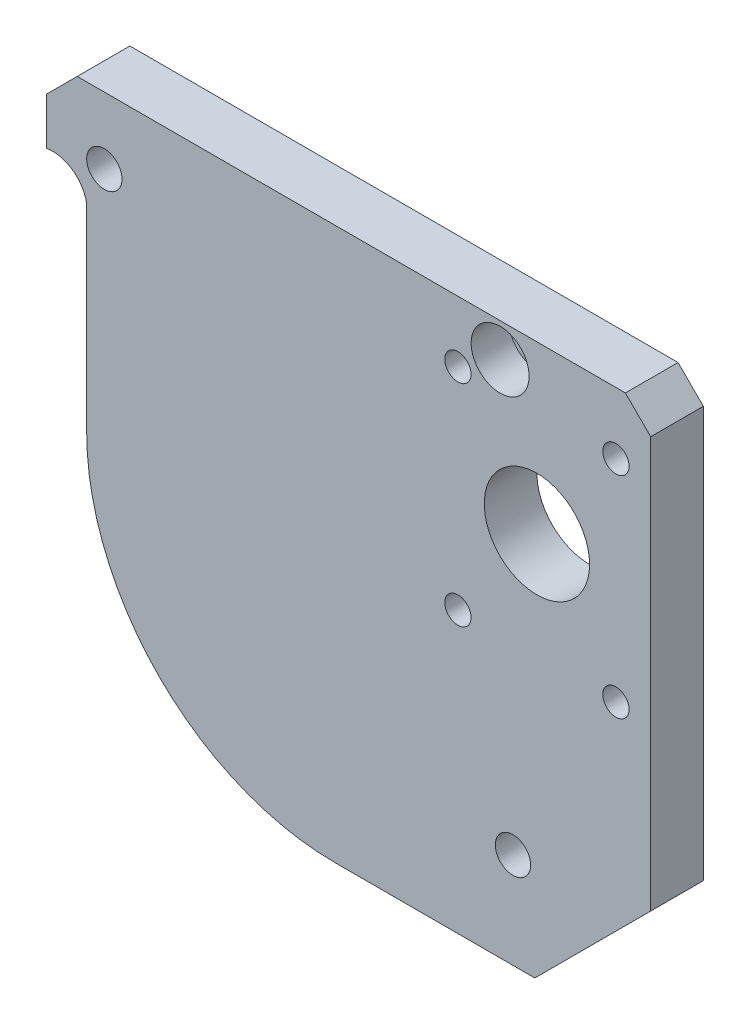
ISO-10303-21;
HEADER;
FILE_DESCRIPTION(('STEP AP214'),'2;1');
FILE_NAME('part.step','',(''),(''),'','','');
FILE_SCHEMA(('AUTOMOTIVE_DESIGN { 1 0 10303 214 1 1 1 1 }'));
ENDSEC;
DATA;
#1=APPLICATION_CONTEXT('core data for automotive mechanical design processes');
#2=APPLICATION_PROTOCOL_DEFINITION('international standard','automotive_design',2000,#1);
#3=PRODUCT_CONTEXT('',#1,'mechanical');
#4=PRODUCT('Part','Part','',(#3));
#5=PRODUCT_RELATED_PRODUCT_CATEGORY('part','',(#4));
#6=PRODUCT_DEFINITION_FORMATION('','',#4);
#7=PRODUCT_DEFINITION_CONTEXT('part definition',#1,'design');
#8=PRODUCT_DEFINITION('design','',#6,#7);
#9=PRODUCT_DEFINITION_SHAPE('','',#8);
#10=(LENGTH_UNIT() NAMED_UNIT(*) SI_UNIT(.MILLI.,.METRE.));
#11=(NAMED_UNIT(*) PLANE_ANGLE_UNIT() SI_UNIT($,.RADIAN.));
#12=(NAMED_UNIT(*) SI_UNIT($,.STERADIAN.) SOLID_ANGLE_UNIT());
#13=UNCERTAINTY_MEASURE_WITH_UNIT(LENGTH_MEASURE(1.E-05),#10,'distance_accuracy_value','');
#14=(GEOMETRIC_REPRESENTATION_CONTEXT(3) GLOBAL_UNCERTAINTY_ASSIGNED_CONTEXT((#13)) GLOBAL_UNIT_ASSIGNED_CONTEXT((#10,
#11,#12)) REPRESENTATION_CONTEXT('',''));
#15=CARTESIAN_POINT('',(0.,0.,0.));
#16=DIRECTION('',(0.,0.,1.));
#17=DIRECTION('',(1.,0.,0.));
#18=AXIS2_PLACEMENT_3D('',#15,#16,#17);
#19=CARTESIAN_POINT('',(4.826,53.8310431675768,0.));
#20=DIRECTION('',(1.,0.,0.));
#21=DIRECTION('',(0.,0.,-1.));
#22=AXIS2_PLACEMENT_3D('',#19,#20,#21);
#23=PLANE('',#22);
#24=DIRECTION('',(0.,0.,1.));
#25=VECTOR('',#24,1.);
#26=CARTESIAN_POINT('',(4.826,29.972,0.));
#27=LINE('',#26,#25);
#28=CARTESIAN_POINT('',(4.826,29.972,0.));
#29=VERTEX_POINT('',#28);
#30=CARTESIAN_POINT('',(4.826,29.972,6.35));
#31=VERTEX_POINT('',#30);
#32=EDGE_CURVE('E245',#29,#31,#27,.T.);
#33=ORIENTED_EDGE('',*,*,#32,.T.);
#34=DIRECTION('',(0.,1.,0.));
#35=VECTOR('',#34,1.);
#36=CARTESIAN_POINT('',(4.826,53.8310431675768,6.35));
#37=LINE('',#36,#35);
#38=CARTESIAN_POINT('',(4.826,53.8310431675768,6.35));
#39=VERTEX_POINT('',#38);
#40=EDGE_CURVE('E237',#31,#39,#37,.T.);
#41=ORIENTED_EDGE('',*,*,#40,.T.);
#42=DIRECTION('',(0.,0.,1.));
#43=VECTOR('',#42,1.);
#44=CARTESIAN_POINT('',(4.826,53.8310431675768,0.));
#45=LINE('',#44,#43);
#46=CARTESIAN_POINT('',(4.826,53.8310431675768,0.));
#47=VERTEX_POINT('',#46);
#48=EDGE_CURVE('E229',#47,#39,#45,.T.);
#49=ORIENTED_EDGE('',*,*,#48,.F.);
#50=DIRECTION('',(0.,1.,0.));
#51=VECTOR('',#50,1.);
#52=CARTESIAN_POINT('',(4.826,53.8310431675768,0.));
#53=LINE('',#52,#51);
#54=EDGE_CURVE('E234',#29,#47,#53,.T.);
#55=ORIENTED_EDGE('',*,*,#54,.F.);
#56=EDGE_LOOP('',(#33,#41,#49,#55));
#57=FACE_BOUND('',#56,.T.);
#58=ADVANCED_FACE('F32',(#57),#23,.F.);
#59=CARTESIAN_POINT('',(54.66715,62.46495,0.));
#60=DIRECTION('',(0.,0.,1.));
#61=DIRECTION('',(1.,0.,0.));
#62=AXIS2_PLACEMENT_3D('',#59,#60,#61);
#63=CYLINDRICAL_SURFACE('',#62,2.12725);
#64=CARTESIAN_POINT('',(54.66715,62.46495,0.));
#65=DIRECTION('',(0.,0.,1.));
#66=DIRECTION('',(1.,0.,0.));
#67=AXIS2_PLACEMENT_3D('',#64,#65,#66);
#68=CIRCLE('',#67,2.12725);
#69=CARTESIAN_POINT('',(56.7944,62.46495,0.));
#70=VERTEX_POINT('',#69);
#71=EDGE_CURVE('E144',#70,#70,#68,.T.);
#72=ORIENTED_EDGE('',*,*,#71,.F.);
#73=EDGE_LOOP('',(#72));
#74=FACE_BOUND('',#73,.T.);
#75=CARTESIAN_POINT('',(54.66715,62.46495,1.778));
#76=DIRECTION('',(0.,0.,1.));
#77=DIRECTION('',(1.,0.,0.));
#78=AXIS2_PLACEMENT_3D('',#75,#76,#77);
#79=CIRCLE('',#78,2.12725);
#80=CARTESIAN_POINT('',(56.7944,62.46495,1.778));
#81=VERTEX_POINT('',#80);
#82=EDGE_CURVE('E141',#81,#81,#79,.F.);
#83=ORIENTED_EDGE('',*,*,#82,.F.);
#84=EDGE_LOOP('',(#83));
#85=FACE_BOUND('',#84,.T.);
#86=ADVANCED_FACE('F283',(#74,#85),#63,.F.);
#87=CARTESIAN_POINT('',(72.8218,0.,6.35));
#88=DIRECTION('',(0.,1.,0.));
#89=DIRECTION('',(-1.,0.,0.));
#90=AXIS2_PLACEMENT_3D('',#87,#88,#89);
#91=PLANE('',#90);
#92=DIRECTION('',(1.,0.,0.));
#93=VECTOR('',#92,1.);
#94=CARTESIAN_POINT('',(72.8218,0.,6.35));
#95=LINE('',#94,#93);
#96=CARTESIAN_POINT('',(34.798,0.,6.35));
#97=VERTEX_POINT('',#96);
#98=CARTESIAN_POINT('',(58.8517999999998,0.,6.35));
#99=VERTEX_POINT('',#98);
#100=EDGE_CURVE('E135',#97,#99,#95,.T.);
#101=ORIENTED_EDGE('',*,*,#100,.F.);
#102=DIRECTION('',(0.,0.,1.));
#103=VECTOR('',#102,1.);
#104=CARTESIAN_POINT('',(34.798,0.,0.));
#105=LINE('',#104,#103);
#106=CARTESIAN_POINT('',(34.798,0.,0.));
#107=VERTEX_POINT('',#106);
#108=EDGE_CURVE('E207',#107,#97,#105,.T.);
#109=ORIENTED_EDGE('',*,*,#108,.F.);
#110=DIRECTION('',(1.,0.,0.));
#111=VECTOR('',#110,1.);
#112=CARTESIAN_POINT('',(72.8218,0.,0.));
#113=LINE('',#112,#111);
#114=CARTESIAN_POINT('',(58.8517999999999,0.,0.));
#115=VERTEX_POINT('',#114);
#116=EDGE_CURVE('E137',#107,#115,#113,.T.);
#117=ORIENTED_EDGE('',*,*,#116,.T.);
#118=DIRECTION('',(0.,0.,1.));
#119=VECTOR('',#118,1.);
#120=CARTESIAN_POINT('',(58.8517999999998,0.,0.));
#121=LINE('',#120,#119);
#122=EDGE_CURVE('E206',#115,#99,#121,.T.);
#123=ORIENTED_EDGE('',*,*,#122,.T.);
#124=EDGE_LOOP('',(#101,#109,#117,#123));
#125=FACE_BOUND('',#124,.T.);
#126=ADVANCED_FACE('F34',(#125),#91,.F.);
#127=CARTESIAN_POINT('',(72.8218,66.548,6.35));
#128=DIRECTION('',(-1.,0.,0.));
#129=DIRECTION('',(0.,-1.,0.));
#130=AXIS2_PLACEMENT_3D('',#127,#128,#129);
#131=PLANE('',#130);
#132=DIRECTION('',(0.,1.,0.));
#133=VECTOR('',#132,1.);
#134=CARTESIAN_POINT('',(72.8218,66.548,0.));
#135=LINE('',#134,#133);
#136=CARTESIAN_POINT('',(72.8218,13.97,0.));
#137=VERTEX_POINT('',#136);
#138=CARTESIAN_POINT('',(72.8218,63.5,0.));
#139=VERTEX_POINT('',#138);
#140=EDGE_CURVE('E132',#137,#139,#135,.T.);
#141=ORIENTED_EDGE('',*,*,#140,.T.);
#142=DIRECTION('',(0.,0.,1.));
#143=VECTOR('',#142,1.);
#144=CARTESIAN_POINT('',(72.8218,63.5,0.));
#145=LINE('',#144,#143);
#146=CARTESIAN_POINT('',(72.8218,63.5,6.35));
#147=VERTEX_POINT('',#146);
#148=EDGE_CURVE('E49',#139,#147,#145,.T.);
#149=ORIENTED_EDGE('',*,*,#148,.T.);
#150=DIRECTION('',(0.,1.,0.));
#151=VECTOR('',#150,1.);
#152=CARTESIAN_POINT('',(72.8218,66.548,6.35));
#153=LINE('',#152,#151);
#154=CARTESIAN_POINT('',(72.8218,13.97,6.35));
#155=VERTEX_POINT('',#154);
#156=EDGE_CURVE('E197',#155,#147,#153,.T.);
#157=ORIENTED_EDGE('',*,*,#156,.F.);
#158=DIRECTION('',(0.,0.,1.));
#159=VECTOR('',#158,1.);
#160=CARTESIAN_POINT('',(72.8218,13.97,0.));
#161=LINE('',#160,#159);
#162=EDGE_CURVE('E217',#137,#155,#161,.T.);
#163=ORIENTED_EDGE('',*,*,#162,.F.);
#164=EDGE_LOOP('',(#141,#149,#157,#163));
#165=FACE_BOUND('',#164,.T.);
#166=ADVANCED_FACE('F255',(#165),#131,.F.);
#167=CARTESIAN_POINT('',(0.,66.548,6.35));
#168=DIRECTION('',(0.,-1.,0.));
#169=DIRECTION('',(0.,0.,-1.));
#170=AXIS2_PLACEMENT_3D('',#167,#168,#169);
#171=PLANE('',#170);
#172=DIRECTION('',(-1.,0.,0.));
#173=VECTOR('',#172,1.);
#174=CARTESIAN_POINT('',(0.,66.548,6.35));
#175=LINE('',#174,#173);
#176=CARTESIAN_POINT('',(69.7738,66.548,6.35));
#177=VERTEX_POINT('',#176);
#178=CARTESIAN_POINT('',(3.68300000000006,66.548,6.35));
#179=VERTEX_POINT('',#178);
#180=EDGE_CURVE('E41',#177,#179,#175,.T.);
#181=ORIENTED_EDGE('',*,*,#180,.F.);
#182=DIRECTION('',(0.,0.,1.));
#183=VECTOR('',#182,1.);
#184=CARTESIAN_POINT('',(69.7738,66.548,0.));
#185=LINE('',#184,#183);
#186=CARTESIAN_POINT('',(69.7738,66.548,0.));
#187=VERTEX_POINT('',#186);
#188=EDGE_CURVE('E111',#187,#177,#185,.T.);
#189=ORIENTED_EDGE('',*,*,#188,.F.);
#190=DIRECTION('',(-1.,0.,0.));
#191=VECTOR('',#190,1.);
#192=CARTESIAN_POINT('',(0.,66.548,0.));
#193=LINE('',#192,#191);
#194=CARTESIAN_POINT('',(3.68300000000008,66.548,0.));
#195=VERTEX_POINT('',#194);
#196=EDGE_CURVE('E123',#187,#195,#193,.T.);
#197=ORIENTED_EDGE('',*,*,#196,.T.);
#198=DIRECTION('',(0.,0.,1.));
#199=VECTOR('',#198,1.);
#200=CARTESIAN_POINT('',(3.68300000000006,66.548,0.));
#201=LINE('',#200,#199);
#202=EDGE_CURVE('E220',#195,#179,#201,.T.);
#203=ORIENTED_EDGE('',*,*,#202,.T.);
#204=EDGE_LOOP('',(#181,#189,#197,#203));
#205=FACE_BOUND('',#204,.T.);
#206=ADVANCED_FACE('F121',(#205),#171,.F.);
#207=CARTESIAN_POINT('',(0.,0.,6.35));
#208=DIRECTION('',(1.,0.,0.));
#209=DIRECTION('',(0.,0.,-1.));
#210=AXIS2_PLACEMENT_3D('',#207,#208,#209);
#211=PLANE('',#210);
#212=DIRECTION('',(0.,-1.,0.));
#213=VECTOR('',#212,1.);
#214=CARTESIAN_POINT('',(0.,0.,0.));
#215=LINE('',#214,#213);
#216=CARTESIAN_POINT('',(0.,62.865,0.));
#217=VERTEX_POINT('',#216);
#218=CARTESIAN_POINT('',(0.,57.1925416335368,0.));
#219=VERTEX_POINT('',#218);
#220=EDGE_CURVE('E131',#217,#219,#215,.T.);
#221=ORIENTED_EDGE('',*,*,#220,.T.);
#222=DIRECTION('',(0.,0.,1.));
#223=VECTOR('',#222,1.);
#224=CARTESIAN_POINT('',(0.,57.1925416335368,0.));
#225=LINE('',#224,#223);
#226=CARTESIAN_POINT('',(0.,57.1925416335368,6.35));
#227=VERTEX_POINT('',#226);
#228=EDGE_CURVE('E231',#219,#227,#225,.T.);
#229=ORIENTED_EDGE('',*,*,#228,.T.);
#230=DIRECTION('',(0.,-1.,0.));
#231=VECTOR('',#230,1.);
#232=CARTESIAN_POINT('',(0.,0.,6.35));
#233=LINE('',#232,#231);
#234=CARTESIAN_POINT('',(0.,62.865,6.35));
#235=VERTEX_POINT('',#234);
#236=EDGE_CURVE('E11',#235,#227,#233,.T.);
#237=ORIENTED_EDGE('',*,*,#236,.F.);
#238=DIRECTION('',(0.,0.,1.));
#239=VECTOR('',#238,1.);
#240=CARTESIAN_POINT('',(0.,62.865,0.));
#241=LINE('',#240,#239);
#242=EDGE_CURVE('E223',#217,#235,#241,.T.);
#243=ORIENTED_EDGE('',*,*,#242,.F.);
#244=EDGE_LOOP('',(#221,#229,#237,#243));
#245=FACE_BOUND('',#244,.T.);
#246=ADVANCED_FACE('F267',(#245),#211,.F.);
#247=CARTESIAN_POINT('',(0.,0.,6.35));
#248=DIRECTION('',(0.,0.,-1.));
#249=DIRECTION('',(-1.,0.,0.));
#250=AXIS2_PLACEMENT_3D('',#247,#248,#249);
#251=PLANE('',#250);
#252=CARTESIAN_POINT('',(49.5808,59.182,6.35));
#253=DIRECTION('',(0.,0.,1.));
#254=DIRECTION('',(1.,0.,0.));
#255=AXIS2_PLACEMENT_3D('',#252,#253,#254);
#256=CIRCLE('',#255,1.5875);
#257=CARTESIAN_POINT('',(51.1683,59.182,6.35));
#258=VERTEX_POINT('',#257);
#259=EDGE_CURVE('E166',#258,#258,#256,.T.);
#260=ORIENTED_EDGE('',*,*,#259,.F.);
#261=EDGE_LOOP('',(#260));
#262=FACE_BOUND('',#261,.T.);
#263=CARTESIAN_POINT('',(68.6308,59.1091100492552,6.35));
#264=DIRECTION('',(0.,0.,1.));
#265=DIRECTION('',(1.,0.,0.));
#266=AXIS2_PLACEMENT_3D('',#263,#264,#265);
#267=CIRCLE('',#266,1.58749999999999);
#268=CARTESIAN_POINT('',(70.2183,59.1091100492552,6.35));
#269=VERTEX_POINT('',#268);
#270=EDGE_CURVE('E156',#269,#269,#267,.T.);
#271=ORIENTED_EDGE('',*,*,#270,.F.);
#272=EDGE_LOOP('',(#271));
#273=FACE_BOUND('',#272,.T.);
#274=CARTESIAN_POINT('',(68.6306605521179,33.709110049638,6.35));
#275=DIRECTION('',(0.,0.,1.));
#276=DIRECTION('',(1.,0.,0.));
#277=AXIS2_PLACEMENT_3D('',#274,#275,#276);
#278=CIRCLE('',#277,1.58749999999999);
#279=CARTESIAN_POINT('',(70.2181605521179,33.709110049638,6.35));
#280=VERTEX_POINT('',#279);
#281=EDGE_CURVE('E153',#280,#280,#278,.T.);
#282=ORIENTED_EDGE('',*,*,#281,.F.);
#283=EDGE_LOOP('',(#282));
#284=FACE_BOUND('',#283,.T.);
#285=CARTESIAN_POINT('',(49.5808,33.782,6.35));
#286=DIRECTION('',(0.,0.,1.));
#287=DIRECTION('',(1.,0.,0.));
#288=AXIS2_PLACEMENT_3D('',#285,#286,#287);
#289=CIRCLE('',#288,1.5875);
#290=CARTESIAN_POINT('',(51.1683,33.782,6.35));
#291=VERTEX_POINT('',#290);
#292=EDGE_CURVE('E150',#291,#291,#289,.T.);
#293=ORIENTED_EDGE('',*,*,#292,.F.);
#294=EDGE_LOOP('',(#293));
#295=FACE_BOUND('',#294,.T.);
#296=CARTESIAN_POINT('',(54.66715,62.46495,6.35));
#297=DIRECTION('',(0.,0.,1.));
#298=DIRECTION('',(1.,0.,0.));
#299=AXIS2_PLACEMENT_3D('',#296,#297,#298);
#300=CIRCLE('',#299,3.49250000000001);
#301=CARTESIAN_POINT('',(58.15965,62.46495,6.35));
#302=VERTEX_POINT('',#301);
#303=EDGE_CURVE('E149',#302,#302,#300,.T.);
#304=ORIENTED_EDGE('',*,*,#303,.F.);
#305=EDGE_LOOP('',(#304));
#306=FACE_BOUND('',#305,.T.);
#307=CARTESIAN_POINT('',(6.95325,58.51525,6.35));
#308=DIRECTION('',(0.,0.,1.));
#309=DIRECTION('',(1.,0.,0.));
#310=AXIS2_PLACEMENT_3D('',#307,#308,#309);
#311=CIRCLE('',#310,2.12725);
#312=CARTESIAN_POINT('',(9.0805,58.51525,6.35));
#313=VERTEX_POINT('',#312);
#314=EDGE_CURVE('E178',#313,#313,#311,.T.);
#315=ORIENTED_EDGE('',*,*,#314,.F.);
#316=EDGE_LOOP('',(#315));
#317=FACE_BOUND('',#316,.T.);
#318=CARTESIAN_POINT('',(56.21655,11.52525,6.35));
#319=DIRECTION('',(0.,0.,1.));
#320=DIRECTION('',(1.,0.,0.));
#321=AXIS2_PLACEMENT_3D('',#318,#319,#320);
#322=CIRCLE('',#321,2.12725);
#323=CARTESIAN_POINT('',(58.3438,11.52525,6.35));
#324=VERTEX_POINT('',#323);
#325=EDGE_CURVE('E182',#324,#324,#322,.T.);
#326=ORIENTED_EDGE('',*,*,#325,.F.);
#327=EDGE_LOOP('',(#326));
#328=FACE_BOUND('',#327,.T.);
#329=CARTESIAN_POINT('',(59.1058,46.482,6.35));
#330=DIRECTION('',(0.,0.,1.));
#331=DIRECTION('',(1.,0.,0.));
#332=AXIS2_PLACEMENT_3D('',#329,#330,#331);
#333=CIRCLE('',#332,6.35000000000002);
#334=CARTESIAN_POINT('',(65.4558,46.482,6.35));
#335=VERTEX_POINT('',#334);
#336=EDGE_CURVE('E188',#335,#335,#333,.T.);
#337=ORIENTED_EDGE('',*,*,#336,.F.);
#338=EDGE_LOOP('',(#337));
#339=FACE_BOUND('',#338,.T.);
#340=ORIENTED_EDGE('',*,*,#156,.T.);
#341=DIRECTION('',(0.707106781186546,-0.707106781186549,0.));
#342=VECTOR('',#341,1.);
#343=CARTESIAN_POINT('',(69.7738,66.548,6.35));
#344=LINE('',#343,#342);
#345=EDGE_CURVE('E117',#177,#147,#344,.T.);
#346=ORIENTED_EDGE('',*,*,#345,.F.);
#347=ORIENTED_EDGE('',*,*,#180,.T.);
#348=DIRECTION('',(0.707106781186553,0.707106781186542,0.));
#349=VECTOR('',#348,1.);
#350=CARTESIAN_POINT('',(3.68300000000006,66.548,6.35));
#351=LINE('',#350,#349);
#352=EDGE_CURVE('E226',#235,#179,#351,.T.);
#353=ORIENTED_EDGE('',*,*,#352,.F.);
#354=ORIENTED_EDGE('',*,*,#236,.T.);
#355=CARTESIAN_POINT('',(0.732250767019983,53.0987924005568,6.35));
#356=DIRECTION('',(0.,0.,1.));
#357=DIRECTION('',(-1.,0.,0.));
#358=AXIS2_PLACEMENT_3D('',#355,#356,#357);
#359=CIRCLE('',#358,4.15872263661883);
#360=EDGE_CURVE('E240',#39,#227,#359,.T.);
#361=ORIENTED_EDGE('',*,*,#360,.F.);
#362=ORIENTED_EDGE('',*,*,#40,.F.);
#363=CARTESIAN_POINT('',(34.798,29.972,6.35));
#364=DIRECTION('',(0.,0.,-1.));
#365=DIRECTION('',(-1.,0.,0.));
#366=AXIS2_PLACEMENT_3D('',#363,#364,#365);
#367=CIRCLE('',#366,29.972);
#368=EDGE_CURVE('E57',#97,#31,#367,.T.);
#369=ORIENTED_EDGE('',*,*,#368,.F.);
#370=ORIENTED_EDGE('',*,*,#100,.T.);
#371=DIRECTION('',(-0.707106781186552,-0.707106781186543,0.));
#372=VECTOR('',#371,1.);
#373=CARTESIAN_POINT('',(72.8218,13.97,6.35));
#374=LINE('',#373,#372);
#375=EDGE_CURVE('E216',#155,#99,#374,.T.);
#376=ORIENTED_EDGE('',*,*,#375,.F.);
#377=EDGE_LOOP('',(#340,#346,#347,#353,#354,#361,#362,#369,#370,#376));
#378=FACE_BOUND('',#377,.T.);
#379=ADVANCED_FACE('F256',(#262,#273,#284,#295,#306,#317,#328,#339,#378),#251,.F.);
#380=CARTESIAN_POINT('',(0.,0.,0.));
#381=DIRECTION('',(0.,0.,-1.));
#382=DIRECTION('',(-1.,0.,0.));
#383=AXIS2_PLACEMENT_3D('',#380,#381,#382);
#384=PLANE('',#383);
#385=DIRECTION('',(0.707106781186546,-0.707106781186549,0.));
#386=VECTOR('',#385,1.);
#387=CARTESIAN_POINT('',(69.7738,66.548,0.));
#388=LINE('',#387,#386);
#389=EDGE_CURVE('E108',#187,#139,#388,.T.);
#390=ORIENTED_EDGE('',*,*,#389,.T.);
#391=ORIENTED_EDGE('',*,*,#140,.F.);
#392=DIRECTION('',(-0.707106781186552,-0.707106781186543,0.));
#393=VECTOR('',#392,1.);
#394=CARTESIAN_POINT('',(72.8218,13.97,0.));
#395=LINE('',#394,#393);
#396=EDGE_CURVE('E213',#137,#115,#395,.T.);
#397=ORIENTED_EDGE('',*,*,#396,.T.);
#398=ORIENTED_EDGE('',*,*,#116,.F.);
#399=CARTESIAN_POINT('',(34.798,29.972,0.));
#400=DIRECTION('',(0.,0.,-1.));
#401=DIRECTION('',(-1.,0.,0.));
#402=AXIS2_PLACEMENT_3D('',#399,#400,#401);
#403=CIRCLE('',#402,29.972);
#404=EDGE_CURVE('E247',#107,#29,#403,.T.);
#405=ORIENTED_EDGE('',*,*,#404,.T.);
#406=ORIENTED_EDGE('',*,*,#54,.T.);
#407=CARTESIAN_POINT('',(0.732250767019983,53.0987924005568,0.));
#408=DIRECTION('',(0.,0.,1.));
#409=DIRECTION('',(-1.,0.,0.));
#410=AXIS2_PLACEMENT_3D('',#407,#408,#409);
#411=CIRCLE('',#410,4.15872263661883);
#412=EDGE_CURVE('E239',#47,#219,#411,.T.);
#413=ORIENTED_EDGE('',*,*,#412,.T.);
#414=ORIENTED_EDGE('',*,*,#220,.F.);
#415=DIRECTION('',(0.707106781186553,0.707106781186542,0.));
#416=VECTOR('',#415,1.);
#417=CARTESIAN_POINT('',(3.68300000000006,66.548,0.));
#418=LINE('',#417,#416);
#419=EDGE_CURVE('E130',#217,#195,#418,.T.);
#420=ORIENTED_EDGE('',*,*,#419,.T.);
#421=ORIENTED_EDGE('',*,*,#196,.F.);
#422=EDGE_LOOP('',(#390,#391,#397,#398,#405,#406,#413,#414,#420,#421));
#423=FACE_BOUND('',#422,.T.);
#424=CARTESIAN_POINT('',(49.5808,59.182,0.));
#425=DIRECTION('',(0.,0.,-1.));
#426=DIRECTION('',(-1.,0.,0.));
#427=AXIS2_PLACEMENT_3D('',#424,#425,#426);
#428=CIRCLE('',#427,1.5875);
#429=CARTESIAN_POINT('',(47.9933,59.182,0.));
#430=VERTEX_POINT('',#429);
#431=EDGE_CURVE('E36',#430,#430,#428,.T.);
#432=ORIENTED_EDGE('',*,*,#431,.F.);
#433=EDGE_LOOP('',(#432));
#434=FACE_BOUND('',#433,.T.);
#435=CARTESIAN_POINT('',(68.6308,59.1091100492552,0.));
#436=DIRECTION('',(0.,0.,-1.));
#437=DIRECTION('',(-1.,0.,0.));
#438=AXIS2_PLACEMENT_3D('',#435,#436,#437);
#439=CIRCLE('',#438,1.58749999999999);
#440=CARTESIAN_POINT('',(67.0433,59.1091100492552,0.));
#441=VERTEX_POINT('',#440);
#442=EDGE_CURVE('E154',#441,#441,#439,.T.);
#443=ORIENTED_EDGE('',*,*,#442,.F.);
#444=EDGE_LOOP('',(#443));
#445=FACE_BOUND('',#444,.T.);
#446=CARTESIAN_POINT('',(68.6306605521179,33.709110049638,0.));
#447=DIRECTION('',(0.,0.,-1.));
#448=DIRECTION('',(-1.,0.,0.));
#449=AXIS2_PLACEMENT_3D('',#446,#447,#448);
#450=CIRCLE('',#449,1.58749999999999);
#451=CARTESIAN_POINT('',(67.0431605521179,33.709110049638,0.));
#452=VERTEX_POINT('',#451);
#453=EDGE_CURVE('E151',#452,#452,#450,.T.);
#454=ORIENTED_EDGE('',*,*,#453,.F.);
#455=EDGE_LOOP('',(#454));
#456=FACE_BOUND('',#455,.T.);
#457=CARTESIAN_POINT('',(49.5808,33.782,0.));
#458=DIRECTION('',(0.,0.,-1.));
#459=DIRECTION('',(-1.,0.,0.));
#460=AXIS2_PLACEMENT_3D('',#457,#458,#459);
#461=CIRCLE('',#460,1.5875);
#462=CARTESIAN_POINT('',(47.9933,33.782,0.));
#463=VERTEX_POINT('',#462);
#464=EDGE_CURVE('E146',#463,#463,#461,.T.);
#465=ORIENTED_EDGE('',*,*,#464,.F.);
#466=EDGE_LOOP('',(#465));
#467=FACE_BOUND('',#466,.T.);
#468=ORIENTED_EDGE('',*,*,#71,.T.);
#469=EDGE_LOOP('',(#468));
#470=FACE_BOUND('',#469,.T.);
#471=CARTESIAN_POINT('',(6.95325,58.51525,0.));
#472=DIRECTION('',(0.,0.,1.));
#473=DIRECTION('',(1.,0.,0.));
#474=AXIS2_PLACEMENT_3D('',#471,#472,#473);
#475=CIRCLE('',#474,2.12725);
#476=CARTESIAN_POINT('',(9.0805,58.51525,0.));
#477=VERTEX_POINT('',#476);
#478=EDGE_CURVE('E179',#477,#477,#475,.T.);
#479=ORIENTED_EDGE('',*,*,#478,.T.);
#480=EDGE_LOOP('',(#479));
#481=FACE_BOUND('',#480,.T.);
#482=CARTESIAN_POINT('',(56.21655,11.52525,0.));
#483=DIRECTION('',(0.,0.,1.));
#484=DIRECTION('',(1.,0.,0.));
#485=AXIS2_PLACEMENT_3D('',#482,#483,#484);
#486=CIRCLE('',#485,2.12725);
#487=CARTESIAN_POINT('',(58.3438,11.52525,0.));
#488=VERTEX_POINT('',#487);
#489=EDGE_CURVE('E185',#488,#488,#486,.T.);
#490=ORIENTED_EDGE('',*,*,#489,.T.);
#491=EDGE_LOOP('',(#490));
#492=FACE_BOUND('',#491,.T.);
#493=CARTESIAN_POINT('',(59.1058,46.482,0.));
#494=DIRECTION('',(0.,0.,1.));
#495=DIRECTION('',(1.,0.,0.));
#496=AXIS2_PLACEMENT_3D('',#493,#494,#495);
#497=CIRCLE('',#496,6.35000000000002);
#498=CARTESIAN_POINT('',(65.4558,46.482,0.));
#499=VERTEX_POINT('',#498);
#500=EDGE_CURVE('E191',#499,#499,#497,.T.);
#501=ORIENTED_EDGE('',*,*,#500,.T.);
#502=EDGE_LOOP('',(#501));
#503=FACE_BOUND('',#502,.T.);
#504=ADVANCED_FACE('F127',(#423,#434,#445,#456,#467,#470,#481,#492,#503),#384,.T.);
#505=CARTESIAN_POINT('',(59.1058,46.482,0.));
#506=DIRECTION('',(0.,0.,1.));
#507=DIRECTION('',(1.,0.,0.));
#508=AXIS2_PLACEMENT_3D('',#505,#506,#507);
#509=CYLINDRICAL_SURFACE('',#508,6.35000000000002);
#510=ORIENTED_EDGE('',*,*,#500,.F.);
#511=EDGE_LOOP('',(#510));
#512=FACE_BOUND('',#511,.T.);
#513=ORIENTED_EDGE('',*,*,#336,.T.);
#514=EDGE_LOOP('',(#513));
#515=FACE_BOUND('',#514,.T.);
#516=ADVANCED_FACE('F360',(#512,#515),#509,.F.);
#517=CARTESIAN_POINT('',(56.21655,11.52525,0.));
#518=DIRECTION('',(0.,0.,1.));
#519=DIRECTION('',(1.,0.,0.));
#520=AXIS2_PLACEMENT_3D('',#517,#518,#519);
#521=CYLINDRICAL_SURFACE('',#520,2.12725);
#522=ORIENTED_EDGE('',*,*,#489,.F.);
#523=EDGE_LOOP('',(#522));
#524=FACE_BOUND('',#523,.T.);
#525=ORIENTED_EDGE('',*,*,#325,.T.);
#526=EDGE_LOOP('',(#525));
#527=FACE_BOUND('',#526,.T.);
#528=ADVANCED_FACE('F369',(#524,#527),#521,.F.);
#529=CARTESIAN_POINT('',(6.95325,58.51525,0.));
#530=DIRECTION('',(0.,0.,1.));
#531=DIRECTION('',(1.,0.,0.));
#532=AXIS2_PLACEMENT_3D('',#529,#530,#531);
#533=CYLINDRICAL_SURFACE('',#532,2.12725);
#534=ORIENTED_EDGE('',*,*,#478,.F.);
#535=EDGE_LOOP('',(#534));
#536=FACE_BOUND('',#535,.T.);
#537=ORIENTED_EDGE('',*,*,#314,.T.);
#538=EDGE_LOOP('',(#537));
#539=FACE_BOUND('',#538,.T.);
#540=ADVANCED_FACE('F376',(#536,#539),#533,.F.);
#541=CARTESIAN_POINT('',(54.66715,62.46495,1.778));
#542=DIRECTION('',(0.,0.,1.));
#543=DIRECTION('',(1.,0.,0.));
#544=AXIS2_PLACEMENT_3D('',#541,#542,#543);
#545=PLANE('',#544);
#546=CARTESIAN_POINT('',(54.66715,62.46495,1.778));
#547=DIRECTION('',(0.,0.,1.));
#548=DIRECTION('',(1.,0.,0.));
#549=AXIS2_PLACEMENT_3D('',#546,#547,#548);
#550=CIRCLE('',#549,3.49250000000001);
#551=CARTESIAN_POINT('',(58.15965,62.46495,1.778));
#552=VERTEX_POINT('',#551);
#553=EDGE_CURVE('E145',#552,#552,#550,.T.);
#554=ORIENTED_EDGE('',*,*,#553,.T.);
#555=EDGE_LOOP('',(#554));
#556=FACE_BOUND('',#555,.T.);
#557=ORIENTED_EDGE('',*,*,#82,.T.);
#558=EDGE_LOOP('',(#557));
#559=FACE_BOUND('',#558,.T.);
#560=ADVANCED_FACE('F384',(#556,#559),#545,.T.);
#561=CARTESIAN_POINT('',(54.66715,62.46495,1.778));
#562=DIRECTION('',(0.,0.,1.));
#563=DIRECTION('',(1.,0.,0.));
#564=AXIS2_PLACEMENT_3D('',#561,#562,#563);
#565=CYLINDRICAL_SURFACE('',#564,3.49250000000001);
#566=ORIENTED_EDGE('',*,*,#553,.F.);
#567=EDGE_LOOP('',(#566));
#568=FACE_BOUND('',#567,.T.);
#569=ORIENTED_EDGE('',*,*,#303,.T.);
#570=EDGE_LOOP('',(#569));
#571=FACE_BOUND('',#570,.T.);
#572=ADVANCED_FACE('F392',(#568,#571),#565,.F.);
#573=CARTESIAN_POINT('',(49.5808,33.782,6.35));
#574=DIRECTION('',(0.,0.,1.));
#575=DIRECTION('',(1.,0.,0.));
#576=AXIS2_PLACEMENT_3D('',#573,#574,#575);
#577=CYLINDRICAL_SURFACE('',#576,1.5875);
#578=ORIENTED_EDGE('',*,*,#464,.T.);
#579=EDGE_LOOP('',(#578));
#580=FACE_BOUND('',#579,.T.);
#581=ORIENTED_EDGE('',*,*,#292,.T.);
#582=EDGE_LOOP('',(#581));
#583=FACE_BOUND('',#582,.T.);
#584=ADVANCED_FACE('F400',(#580,#583),#577,.F.);
#585=CARTESIAN_POINT('',(68.6306605521179,33.709110049638,6.35));
#586=DIRECTION('',(0.,0.,1.));
#587=DIRECTION('',(1.,0.,0.));
#588=AXIS2_PLACEMENT_3D('',#585,#586,#587);
#589=CYLINDRICAL_SURFACE('',#588,1.58749999999999);
#590=ORIENTED_EDGE('',*,*,#453,.T.);
#591=EDGE_LOOP('',(#590));
#592=FACE_BOUND('',#591,.T.);
#593=ORIENTED_EDGE('',*,*,#281,.T.);
#594=EDGE_LOOP('',(#593));
#595=FACE_BOUND('',#594,.T.);
#596=ADVANCED_FACE('F408',(#592,#595),#589,.F.);
#597=CARTESIAN_POINT('',(68.6308,59.1091100492552,6.35));
#598=DIRECTION('',(0.,0.,1.));
#599=DIRECTION('',(1.,0.,0.));
#600=AXIS2_PLACEMENT_3D('',#597,#598,#599);
#601=CYLINDRICAL_SURFACE('',#600,1.58749999999999);
#602=ORIENTED_EDGE('',*,*,#442,.T.);
#603=EDGE_LOOP('',(#602));
#604=FACE_BOUND('',#603,.T.);
#605=ORIENTED_EDGE('',*,*,#270,.T.);
#606=EDGE_LOOP('',(#605));
#607=FACE_BOUND('',#606,.T.);
#608=ADVANCED_FACE('F416',(#604,#607),#601,.F.);
#609=CARTESIAN_POINT('',(49.5808,59.182,6.35));
#610=DIRECTION('',(0.,0.,1.));
#611=DIRECTION('',(1.,0.,0.));
#612=AXIS2_PLACEMENT_3D('',#609,#610,#611);
#613=CYLINDRICAL_SURFACE('',#612,1.5875);
#614=ORIENTED_EDGE('',*,*,#431,.T.);
#615=EDGE_LOOP('',(#614));
#616=FACE_BOUND('',#615,.T.);
#617=ORIENTED_EDGE('',*,*,#259,.T.);
#618=EDGE_LOOP('',(#617));
#619=FACE_BOUND('',#618,.T.);
#620=ADVANCED_FACE('F280',(#616,#619),#613,.F.);
#621=CARTESIAN_POINT('',(72.8218,13.97,0.));
#622=DIRECTION('',(-0.707106781186543,0.707106781186552,0.));
#623=DIRECTION('',(-0.707106781186552,-0.707106781186543,0.));
#624=AXIS2_PLACEMENT_3D('',#621,#622,#623);
#625=PLANE('',#624);
#626=ORIENTED_EDGE('',*,*,#375,.T.);
#627=ORIENTED_EDGE('',*,*,#122,.F.);
#628=ORIENTED_EDGE('',*,*,#396,.F.);
#629=ORIENTED_EDGE('',*,*,#162,.T.);
#630=EDGE_LOOP('',(#626,#627,#628,#629));
#631=FACE_BOUND('',#630,.T.);
#632=ADVANCED_FACE('F212',(#631),#625,.F.);
#633=CARTESIAN_POINT('',(3.68300000000006,66.548,0.));
#634=DIRECTION('',(0.707106781186542,-0.707106781186553,0.));
#635=DIRECTION('',(0.707106781186553,0.707106781186542,0.));
#636=AXIS2_PLACEMENT_3D('',#633,#634,#635);
#637=PLANE('',#636);
#638=ORIENTED_EDGE('',*,*,#352,.T.);
#639=ORIENTED_EDGE('',*,*,#202,.F.);
#640=ORIENTED_EDGE('',*,*,#419,.F.);
#641=ORIENTED_EDGE('',*,*,#242,.T.);
#642=EDGE_LOOP('',(#638,#639,#640,#641));
#643=FACE_BOUND('',#642,.T.);
#644=ADVANCED_FACE('F271',(#643),#637,.F.);
#645=CARTESIAN_POINT('',(0.732250767019983,53.0987924005568,0.));
#646=DIRECTION('',(0.,0.,1.));
#647=DIRECTION('',(1.,0.,0.));
#648=AXIS2_PLACEMENT_3D('',#645,#646,#647);
#649=CYLINDRICAL_SURFACE('',#648,4.15872263661883);
#650=ORIENTED_EDGE('',*,*,#360,.T.);
#651=ORIENTED_EDGE('',*,*,#228,.F.);
#652=ORIENTED_EDGE('',*,*,#412,.F.);
#653=ORIENTED_EDGE('',*,*,#48,.T.);
#654=EDGE_LOOP('',(#650,#651,#652,#653));
#655=FACE_BOUND('',#654,.T.);
#656=ADVANCED_FACE('F264',(#655),#649,.F.);
#657=CARTESIAN_POINT('',(34.798,29.972,0.));
#658=DIRECTION('',(0.,0.,1.));
#659=DIRECTION('',(1.,0.,0.));
#660=AXIS2_PLACEMENT_3D('',#657,#658,#659);
#661=CYLINDRICAL_SURFACE('',#660,29.972);
#662=ORIENTED_EDGE('',*,*,#368,.T.);
#663=ORIENTED_EDGE('',*,*,#32,.F.);
#664=ORIENTED_EDGE('',*,*,#404,.F.);
#665=ORIENTED_EDGE('',*,*,#108,.T.);
#666=EDGE_LOOP('',(#662,#663,#664,#665));
#667=FACE_BOUND('',#666,.T.);
#668=ADVANCED_FACE('F278',(#667),#661,.T.);
#669=CARTESIAN_POINT('',(69.7738,66.548,0.));
#670=DIRECTION('',(-0.707106781186549,-0.707106781186546,0.));
#671=DIRECTION('',(0.707106781186546,-0.707106781186549,0.));
#672=AXIS2_PLACEMENT_3D('',#669,#670,#671);
#673=PLANE('',#672);
#674=ORIENTED_EDGE('',*,*,#345,.T.);
#675=ORIENTED_EDGE('',*,*,#148,.F.);
#676=ORIENTED_EDGE('',*,*,#389,.F.);
#677=ORIENTED_EDGE('',*,*,#188,.T.);
#678=EDGE_LOOP('',(#674,#675,#676,#677));
#679=FACE_BOUND('',#678,.T.);
#680=ADVANCED_FACE('F110',(#679),#673,.F.);
#681=CLOSED_SHELL('',(#58,#86,#126,#166,#206,#246,#379,#504,#516,#528,#540,#560,#572,#584,#596,
#608,#620,#632,#644,#656,#668,#680));
#682=MANIFOLD_SOLID_BREP('B2',#681);
#683=ADVANCED_BREP_SHAPE_REPRESENTATION('',(#18,#682),#14);
#684=SHAPE_DEFINITION_REPRESENTATION(#9,#683);
ENDSEC;
END-ISO-10303-21;
